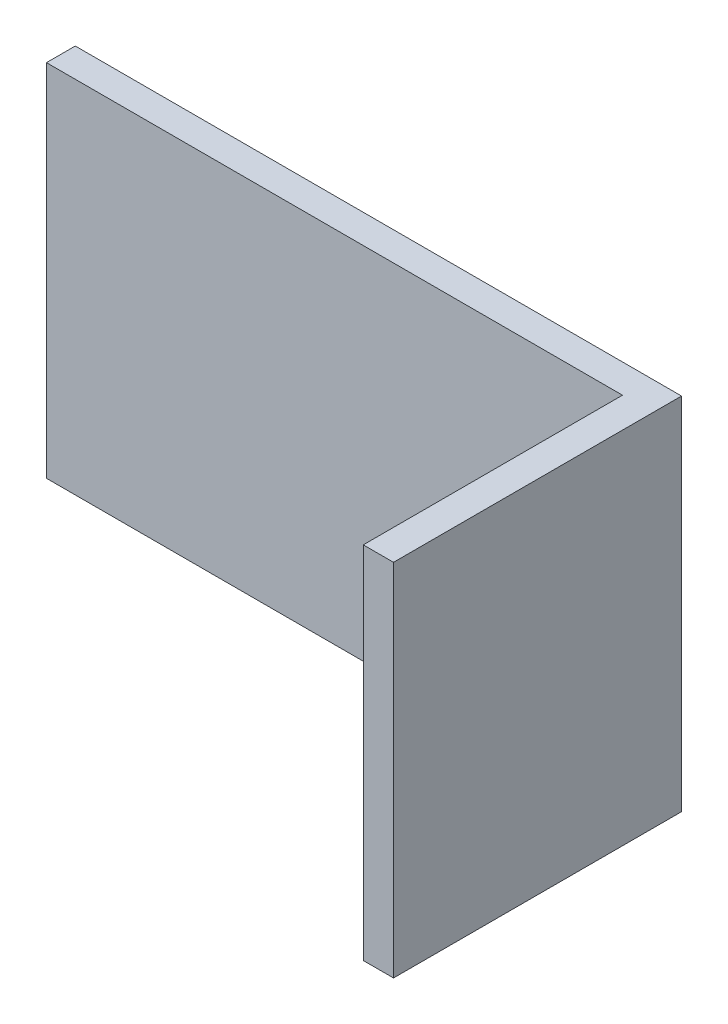
ISO-10303-21;
HEADER;
FILE_DESCRIPTION(('STEP AP214'),'2;1');
FILE_NAME('part.step','',(''),(''),'','','');
FILE_SCHEMA(('AUTOMOTIVE_DESIGN { 1 0 10303 214 1 1 1 1 }'));
ENDSEC;
DATA;
#1=APPLICATION_CONTEXT('core data for automotive mechanical design processes');
#2=APPLICATION_PROTOCOL_DEFINITION('international standard','automotive_design',2000,#1);
#3=PRODUCT_CONTEXT('',#1,'mechanical');
#4=PRODUCT('Part','Part','',(#3));
#5=PRODUCT_RELATED_PRODUCT_CATEGORY('part','',(#4));
#6=PRODUCT_DEFINITION_FORMATION('','',#4);
#7=PRODUCT_DEFINITION_CONTEXT('part definition',#1,'design');
#8=PRODUCT_DEFINITION('design','',#6,#7);
#9=PRODUCT_DEFINITION_SHAPE('','',#8);
#10=(LENGTH_UNIT() NAMED_UNIT(*) SI_UNIT(.MILLI.,.METRE.));
#11=(NAMED_UNIT(*) PLANE_ANGLE_UNIT() SI_UNIT($,.RADIAN.));
#12=(NAMED_UNIT(*) SI_UNIT($,.STERADIAN.) SOLID_ANGLE_UNIT());
#13=UNCERTAINTY_MEASURE_WITH_UNIT(LENGTH_MEASURE(1.E-05),#10,'distance_accuracy_value','');
#14=(GEOMETRIC_REPRESENTATION_CONTEXT(3) GLOBAL_UNCERTAINTY_ASSIGNED_CONTEXT((#13)) GLOBAL_UNIT_ASSIGNED_CONTEXT((#10,
#11,#12)) REPRESENTATION_CONTEXT('',''));
#15=CARTESIAN_POINT('',(0.,0.,0.));
#16=DIRECTION('',(0.,0.,1.));
#17=DIRECTION('',(1.,0.,0.));
#18=AXIS2_PLACEMENT_3D('',#15,#16,#17);
#19=CARTESIAN_POINT('',(1.48217930040456,0.25,0.2));
#20=DIRECTION('',(0.,0.,1.));
#21=DIRECTION('',(1.,0.,0.));
#22=AXIS2_PLACEMENT_3D('',#19,#20,#21);
#23=PLANE('',#22);
#24=DIRECTION('',(0.,-1.,0.));
#25=VECTOR('',#24,1.);
#26=CARTESIAN_POINT('',(1.49267930040456,0.25,0.2));
#27=LINE('',#26,#25);
#28=CARTESIAN_POINT('',(1.49267930040456,0.375,0.2));
#29=VERTEX_POINT('',#28);
#30=CARTESIAN_POINT('',(1.49267930040456,0.125,0.2));
#31=VERTEX_POINT('',#30);
#32=EDGE_CURVE('E92',#29,#31,#27,.T.);
#33=ORIENTED_EDGE('',*,*,#32,.F.);
#34=DIRECTION('',(1.,0.,0.));
#35=VECTOR('',#34,1.);
#36=CARTESIAN_POINT('',(1.34015031489732,0.375,0.2));
#37=LINE('',#36,#35);
#38=CARTESIAN_POINT('',(1.47167930040457,0.375,0.2));
#39=VERTEX_POINT('',#38);
#40=EDGE_CURVE('E125',#39,#29,#37,.T.);
#41=ORIENTED_EDGE('',*,*,#40,.F.);
#42=DIRECTION('',(0.,-1.,0.));
#43=VECTOR('',#42,1.);
#44=CARTESIAN_POINT('',(1.47167930040457,0.25,0.2));
#45=LINE('',#44,#43);
#46=CARTESIAN_POINT('',(1.47167930040457,0.125,0.2));
#47=VERTEX_POINT('',#46);
#48=EDGE_CURVE('E11',#39,#47,#45,.T.);
#49=ORIENTED_EDGE('',*,*,#48,.T.);
#50=DIRECTION('',(1.,0.,0.));
#51=VECTOR('',#50,1.);
#52=CARTESIAN_POINT('',(1.34015031489732,0.125,0.2));
#53=LINE('',#52,#51);
#54=EDGE_CURVE('E139',#47,#31,#53,.T.);
#55=ORIENTED_EDGE('',*,*,#54,.T.);
#56=EDGE_LOOP('',(#33,#41,#49,#55));
#57=FACE_BOUND('',#56,.T.);
#58=ADVANCED_FACE('F16',(#57),#23,.T.);
#59=CARTESIAN_POINT('',(1.27167930040456,0.25,0.02));
#60=DIRECTION('',(0.,0.,1.));
#61=DIRECTION('',(1.,0.,0.));
#62=AXIS2_PLACEMENT_3D('',#59,#60,#61);
#63=PLANE('',#62);
#64=DIRECTION('',(1.,0.,0.));
#65=VECTOR('',#64,1.);
#66=CARTESIAN_POINT('',(1.34015031489732,0.375,0.02));
#67=LINE('',#66,#65);
#68=CARTESIAN_POINT('',(1.07167930040456,0.375,0.02));
#69=VERTEX_POINT('',#68);
#70=CARTESIAN_POINT('',(1.47167930040457,0.375,0.02));
#71=VERTEX_POINT('',#70);
#72=EDGE_CURVE('E103',#69,#71,#67,.T.);
#73=ORIENTED_EDGE('',*,*,#72,.F.);
#74=DIRECTION('',(0.,-1.,0.));
#75=VECTOR('',#74,1.);
#76=CARTESIAN_POINT('',(1.07167930040456,0.25,0.02));
#77=LINE('',#76,#75);
#78=CARTESIAN_POINT('',(1.07167930040456,0.125,0.02));
#79=VERTEX_POINT('',#78);
#80=EDGE_CURVE('E42',#69,#79,#77,.T.);
#81=ORIENTED_EDGE('',*,*,#80,.T.);
#82=DIRECTION('',(1.,0.,0.));
#83=VECTOR('',#82,1.);
#84=CARTESIAN_POINT('',(1.34015031489732,0.125,0.02));
#85=LINE('',#84,#83);
#86=CARTESIAN_POINT('',(1.47167930040457,0.125,0.02));
#87=VERTEX_POINT('',#86);
#88=EDGE_CURVE('E153',#79,#87,#85,.T.);
#89=ORIENTED_EDGE('',*,*,#88,.T.);
#90=DIRECTION('',(0.,1.,0.));
#91=VECTOR('',#90,1.);
#92=CARTESIAN_POINT('',(1.47167930040457,0.25,0.02));
#93=LINE('',#92,#91);
#94=EDGE_CURVE('E27',#87,#71,#93,.T.);
#95=ORIENTED_EDGE('',*,*,#94,.T.);
#96=EDGE_LOOP('',(#73,#81,#89,#95));
#97=FACE_BOUND('',#96,.T.);
#98=ADVANCED_FACE('F173',(#97),#63,.T.);
#99=CARTESIAN_POINT('',(1.47167930040457,0.25,0.11));
#100=DIRECTION('',(1.,0.,0.));
#101=DIRECTION('',(0.,0.,1.));
#102=AXIS2_PLACEMENT_3D('',#99,#100,#101);
#103=PLANE('',#102);
#104=DIRECTION('',(0.,0.,1.));
#105=VECTOR('',#104,1.);
#106=CARTESIAN_POINT('',(1.47167930040457,0.375,0.0420289855072459));
#107=LINE('',#106,#105);
#108=EDGE_CURVE('E121',#71,#39,#107,.T.);
#109=ORIENTED_EDGE('',*,*,#108,.F.);
#110=ORIENTED_EDGE('',*,*,#94,.F.);
#111=DIRECTION('',(0.,0.,1.));
#112=VECTOR('',#111,1.);
#113=CARTESIAN_POINT('',(1.47167930040457,0.125,0.0420289855072459));
#114=LINE('',#113,#112);
#115=EDGE_CURVE('E145',#87,#47,#114,.T.);
#116=ORIENTED_EDGE('',*,*,#115,.T.);
#117=ORIENTED_EDGE('',*,*,#48,.F.);
#118=EDGE_LOOP('',(#109,#110,#116,#117));
#119=FACE_BOUND('',#118,.T.);
#120=ADVANCED_FACE('F168',(#119),#103,.F.);
#121=CARTESIAN_POINT('',(1.07167930040456,0.25,0.01));
#122=DIRECTION('',(1.,0.,0.));
#123=DIRECTION('',(0.,0.,1.));
#124=AXIS2_PLACEMENT_3D('',#121,#122,#123);
#125=PLANE('',#124);
#126=DIRECTION('',(0.,0.,1.));
#127=VECTOR('',#126,1.);
#128=CARTESIAN_POINT('',(1.07167930040456,0.125,0.0420289855072459));
#129=LINE('',#128,#127);
#130=CARTESIAN_POINT('',(1.07167930040456,0.125,0.));
#131=VERTEX_POINT('',#130);
#132=EDGE_CURVE('E127',#131,#79,#129,.T.);
#133=ORIENTED_EDGE('',*,*,#132,.T.);
#134=ORIENTED_EDGE('',*,*,#80,.F.);
#135=DIRECTION('',(0.,0.,1.));
#136=VECTOR('',#135,1.);
#137=CARTESIAN_POINT('',(1.07167930040456,0.375,0.0420289855072459));
#138=LINE('',#137,#136);
#139=CARTESIAN_POINT('',(1.07167930040456,0.375,0.));
#140=VERTEX_POINT('',#139);
#141=EDGE_CURVE('E20',#140,#69,#138,.T.);
#142=ORIENTED_EDGE('',*,*,#141,.F.);
#143=DIRECTION('',(0.,-1.,0.));
#144=VECTOR('',#143,1.);
#145=CARTESIAN_POINT('',(1.07167930040456,0.25,0.));
#146=LINE('',#145,#144);
#147=EDGE_CURVE('E87',#140,#131,#146,.T.);
#148=ORIENTED_EDGE('',*,*,#147,.T.);
#149=EDGE_LOOP('',(#133,#134,#142,#148));
#150=FACE_BOUND('',#149,.T.);
#151=ADVANCED_FACE('F85',(#150),#125,.F.);
#152=CARTESIAN_POINT('',(1.34015031489732,0.125,0.0420289855072459));
#153=DIRECTION('',(0.,1.,0.));
#154=DIRECTION('',(1.,0.,0.));
#155=AXIS2_PLACEMENT_3D('',#152,#153,#154);
#156=PLANE('',#155);
#157=DIRECTION('',(0.,0.,-1.));
#158=VECTOR('',#157,1.);
#159=CARTESIAN_POINT('',(1.49267930040456,0.125,0.0999999999999988));
#160=LINE('',#159,#158);
#161=CARTESIAN_POINT('',(1.49267930040456,0.125,0.));
#162=VERTEX_POINT('',#161);
#163=EDGE_CURVE('E136',#31,#162,#160,.T.);
#164=ORIENTED_EDGE('',*,*,#163,.F.);
#165=ORIENTED_EDGE('',*,*,#54,.F.);
#166=ORIENTED_EDGE('',*,*,#115,.F.);
#167=ORIENTED_EDGE('',*,*,#88,.F.);
#168=ORIENTED_EDGE('',*,*,#132,.F.);
#169=DIRECTION('',(1.,0.,0.));
#170=VECTOR('',#169,1.);
#171=CARTESIAN_POINT('',(1.28217930040456,0.125,0.));
#172=LINE('',#171,#170);
#173=EDGE_CURVE('E107',#131,#162,#172,.T.);
#174=ORIENTED_EDGE('',*,*,#173,.T.);
#175=EDGE_LOOP('',(#164,#165,#166,#167,#168,#174));
#176=FACE_BOUND('',#175,.T.);
#177=ADVANCED_FACE('F165',(#176),#156,.F.);
#178=CARTESIAN_POINT('',(1.49267930040456,0.25,0.0999999999999988));
#179=DIRECTION('',(1.,0.,0.));
#180=DIRECTION('',(0.,0.,-1.));
#181=AXIS2_PLACEMENT_3D('',#178,#179,#180);
#182=PLANE('',#181);
#183=ORIENTED_EDGE('',*,*,#32,.T.);
#184=ORIENTED_EDGE('',*,*,#163,.T.);
#185=DIRECTION('',(0.,1.,0.));
#186=VECTOR('',#185,1.);
#187=CARTESIAN_POINT('',(1.49267930040456,0.25,0.));
#188=LINE('',#187,#186);
#189=CARTESIAN_POINT('',(1.49267930040456,0.375,0.));
#190=VERTEX_POINT('',#189);
#191=EDGE_CURVE('E115',#162,#190,#188,.T.);
#192=ORIENTED_EDGE('',*,*,#191,.T.);
#193=DIRECTION('',(0.,0.,-1.));
#194=VECTOR('',#193,1.);
#195=CARTESIAN_POINT('',(1.49267930040456,0.375,0.0420289855072459));
#196=LINE('',#195,#194);
#197=EDGE_CURVE('E93',#29,#190,#196,.T.);
#198=ORIENTED_EDGE('',*,*,#197,.F.);
#199=EDGE_LOOP('',(#183,#184,#192,#198));
#200=FACE_BOUND('',#199,.T.);
#201=ADVANCED_FACE('F240',(#200),#182,.T.);
#202=CARTESIAN_POINT('',(1.34015031489732,0.375,0.0420289855072459));
#203=DIRECTION('',(0.,1.,0.));
#204=DIRECTION('',(0.,0.,-1.));
#205=AXIS2_PLACEMENT_3D('',#202,#203,#204);
#206=PLANE('',#205);
#207=ORIENTED_EDGE('',*,*,#72,.T.);
#208=ORIENTED_EDGE('',*,*,#108,.T.);
#209=ORIENTED_EDGE('',*,*,#40,.T.);
#210=ORIENTED_EDGE('',*,*,#197,.T.);
#211=DIRECTION('',(-1.,0.,0.));
#212=VECTOR('',#211,1.);
#213=CARTESIAN_POINT('',(1.28217930040456,0.375,0.));
#214=LINE('',#213,#212);
#215=EDGE_CURVE('E96',#190,#140,#214,.T.);
#216=ORIENTED_EDGE('',*,*,#215,.T.);
#217=ORIENTED_EDGE('',*,*,#141,.T.);
#218=EDGE_LOOP('',(#207,#208,#209,#210,#216,#217));
#219=FACE_BOUND('',#218,.T.);
#220=ADVANCED_FACE('F18',(#219),#206,.T.);
#221=CARTESIAN_POINT('',(1.28217930040456,0.25,0.));
#222=DIRECTION('',(0.,0.,1.));
#223=DIRECTION('',(1.,0.,0.));
#224=AXIS2_PLACEMENT_3D('',#221,#222,#223);
#225=PLANE('',#224);
#226=ORIENTED_EDGE('',*,*,#191,.F.);
#227=ORIENTED_EDGE('',*,*,#173,.F.);
#228=ORIENTED_EDGE('',*,*,#147,.F.);
#229=ORIENTED_EDGE('',*,*,#215,.F.);
#230=EDGE_LOOP('',(#226,#227,#228,#229));
#231=FACE_BOUND('',#230,.T.);
#232=ADVANCED_FACE('F105',(#231),#225,.F.);
#233=CLOSED_SHELL('',(#58,#98,#120,#151,#177,#201,#220,#232));
#234=MANIFOLD_SOLID_BREP('B1',#233);
#235=ADVANCED_BREP_SHAPE_REPRESENTATION('',(#18,#234),#14);
#236=SHAPE_DEFINITION_REPRESENTATION(#9,#235);
ENDSEC;
END-ISO-10303-21;
